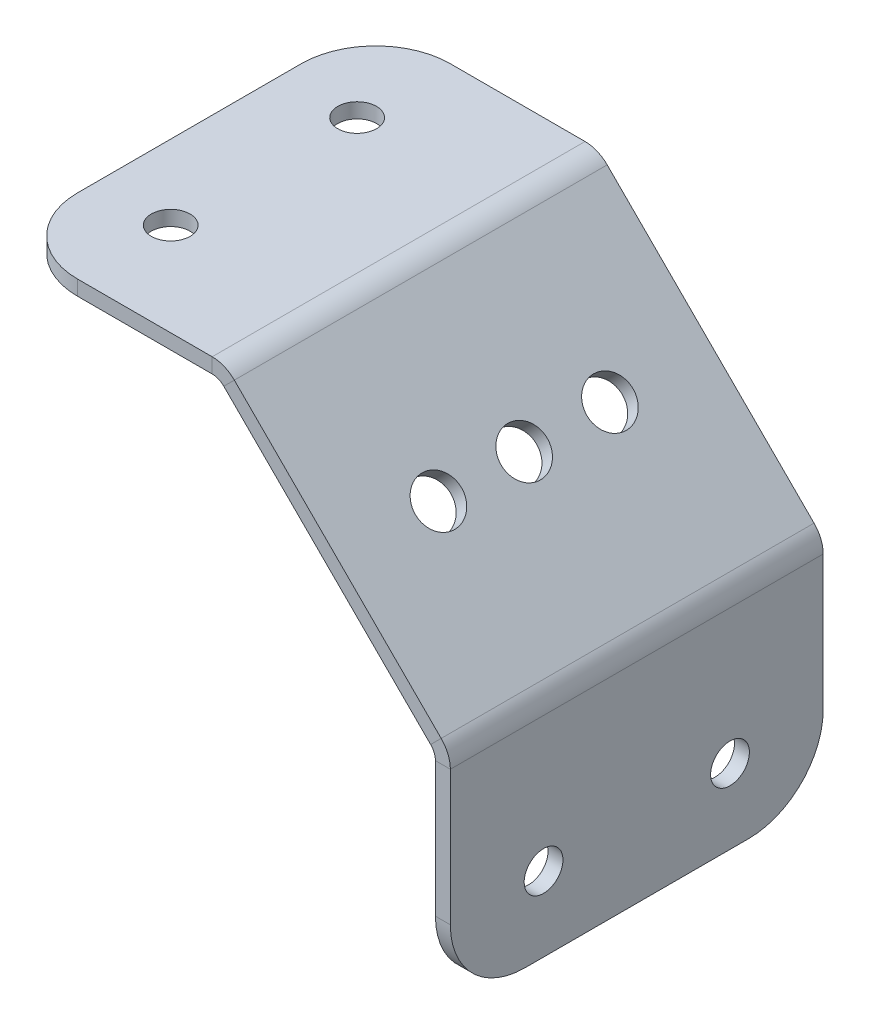
ISO-10303-21;
HEADER;
FILE_DESCRIPTION(('STEP AP214'),'2;1');
FILE_NAME('part.step','',(''),(''),'','','');
FILE_SCHEMA(('AUTOMOTIVE_DESIGN { 1 0 10303 214 1 1 1 1 }'));
ENDSEC;
DATA;
#1=APPLICATION_CONTEXT('core data for automotive mechanical design processes');
#2=APPLICATION_PROTOCOL_DEFINITION('international standard','automotive_design',2000,#1);
#3=PRODUCT_CONTEXT('',#1,'mechanical');
#4=PRODUCT('Part','Part','',(#3));
#5=PRODUCT_RELATED_PRODUCT_CATEGORY('part','',(#4));
#6=PRODUCT_DEFINITION_FORMATION('','',#4);
#7=PRODUCT_DEFINITION_CONTEXT('part definition',#1,'design');
#8=PRODUCT_DEFINITION('design','',#6,#7);
#9=PRODUCT_DEFINITION_SHAPE('','',#8);
#10=(LENGTH_UNIT() NAMED_UNIT(*) SI_UNIT(.MILLI.,.METRE.));
#11=(NAMED_UNIT(*) PLANE_ANGLE_UNIT() SI_UNIT($,.RADIAN.));
#12=(NAMED_UNIT(*) SI_UNIT($,.STERADIAN.) SOLID_ANGLE_UNIT());
#13=UNCERTAINTY_MEASURE_WITH_UNIT(LENGTH_MEASURE(1.E-05),#10,'distance_accuracy_value','');
#14=(GEOMETRIC_REPRESENTATION_CONTEXT(3) GLOBAL_UNCERTAINTY_ASSIGNED_CONTEXT((#13)) GLOBAL_UNIT_ASSIGNED_CONTEXT((#10,
#11,#12)) REPRESENTATION_CONTEXT('',''));
#15=CARTESIAN_POINT('',(0.,0.,0.));
#16=DIRECTION('',(0.,0.,1.));
#17=DIRECTION('',(1.,0.,0.));
#18=AXIS2_PLACEMENT_3D('',#15,#16,#17);
#19=CARTESIAN_POINT('',(2.25354831445098,34.1905209076565,-25.));
#20=DIRECTION('',(0.,0.,-1.));
#21=DIRECTION('',(-1.,0.,0.));
#22=AXIS2_PLACEMENT_3D('',#19,#20,#21);
#23=PLANE('',#22);
#24=DIRECTION('',(0.707106781186538,-0.707106781186557,0.));
#25=VECTOR('',#24,1.);
#26=CARTESIAN_POINT('',(3.16481815167181,32.1905209076565,-25.));
#27=LINE('',#26,#25);
#28=CARTESIAN_POINT('',(3.80918323306141,31.5461558262669,-25.));
#29=VERTEX_POINT('',#28);
#30=CARTESIAN_POINT('',(31.5461558262669,3.80918323306073,-25.));
#31=VERTEX_POINT('',#30);
#32=EDGE_CURVE('E59',#29,#31,#27,.T.);
#33=ORIENTED_EDGE('',*,*,#32,.F.);
#34=DIRECTION('',(0.707106781186557,0.707106781186538,0.));
#35=VECTOR('',#34,1.);
#36=CARTESIAN_POINT('',(3.80918323306142,31.5461558262669,-25.));
#37=LINE('',#36,#35);
#38=CARTESIAN_POINT('',(5.22339679543453,32.96036938864,-25.));
#39=VERTEX_POINT('',#38);
#40=EDGE_CURVE('E346',#29,#39,#37,.T.);
#41=ORIENTED_EDGE('',*,*,#40,.T.);
#42=DIRECTION('',(0.707106781186538,-0.707106781186557,0.));
#43=VECTOR('',#42,1.);
#44=CARTESIAN_POINT('',(4.57903171404493,33.6047344700296,-25.));
#45=LINE('',#44,#43);
#46=CARTESIAN_POINT('',(32.96036938864,5.2233967954338,-25.));
#47=VERTEX_POINT('',#46);
#48=EDGE_CURVE('E325',#39,#47,#45,.T.);
#49=ORIENTED_EDGE('',*,*,#48,.T.);
#50=DIRECTION('',(-0.707106781186557,-0.707106781186537,0.));
#51=VECTOR('',#50,1.);
#52=CARTESIAN_POINT('',(32.96036938864,5.2233967954338,-25.));
#53=LINE('',#52,#51);
#54=EDGE_CURVE('E342',#47,#31,#53,.T.);
#55=ORIENTED_EDGE('',*,*,#54,.T.);
#56=EDGE_LOOP('',(#33,#41,#49,#55));
#57=FACE_BOUND('',#56,.T.);
#58=ADVANCED_FACE('F38',(#57),#23,.T.);
#59=CARTESIAN_POINT('',(34.1905209076564,2.25354831445035,25.));
#60=DIRECTION('',(0.,0.,1.));
#61=DIRECTION('',(1.,0.,0.));
#62=AXIS2_PLACEMENT_3D('',#59,#60,#61);
#63=PLANE('',#62);
#64=DIRECTION('',(0.707106781186538,-0.707106781186557,0.));
#65=VECTOR('',#64,1.);
#66=CARTESIAN_POINT('',(3.16481815167181,32.1905209076565,25.));
#67=LINE('',#66,#65);
#68=CARTESIAN_POINT('',(3.80918323306142,31.5461558262669,25.));
#69=VERTEX_POINT('',#68);
#70=CARTESIAN_POINT('',(31.5461558262669,3.80918323306072,25.));
#71=VERTEX_POINT('',#70);
#72=EDGE_CURVE('E52',#69,#71,#67,.T.);
#73=ORIENTED_EDGE('',*,*,#72,.T.);
#74=DIRECTION('',(0.707106781186557,0.707106781186537,0.));
#75=VECTOR('',#74,1.);
#76=CARTESIAN_POINT('',(31.5461558262669,3.80918323306073,25.));
#77=LINE('',#76,#75);
#78=CARTESIAN_POINT('',(32.96036938864,5.2233967954338,25.));
#79=VERTEX_POINT('',#78);
#80=EDGE_CURVE('E337',#71,#79,#77,.T.);
#81=ORIENTED_EDGE('',*,*,#80,.T.);
#82=DIRECTION('',(0.707106781186538,-0.707106781186557,0.));
#83=VECTOR('',#82,1.);
#84=CARTESIAN_POINT('',(4.57903171404493,33.6047344700296,25.));
#85=LINE('',#84,#83);
#86=CARTESIAN_POINT('',(5.22339679543453,32.96036938864,25.));
#87=VERTEX_POINT('',#86);
#88=EDGE_CURVE('E320',#87,#79,#85,.T.);
#89=ORIENTED_EDGE('',*,*,#88,.F.);
#90=DIRECTION('',(-0.707106781186557,-0.707106781186538,0.));
#91=VECTOR('',#90,1.);
#92=CARTESIAN_POINT('',(5.22339679543453,32.96036938864,25.));
#93=LINE('',#92,#91);
#94=EDGE_CURVE('E11',#87,#69,#93,.T.);
#95=ORIENTED_EDGE('',*,*,#94,.T.);
#96=EDGE_LOOP('',(#73,#81,#89,#95));
#97=FACE_BOUND('',#96,.T.);
#98=ADVANCED_FACE('F386',(#97),#63,.T.);
#99=CARTESIAN_POINT('',(4.57903171404493,33.6047344700296,25.));
#100=DIRECTION('',(0.707106781186557,0.707106781186538,0.));
#101=DIRECTION('',(-0.707106781186538,0.707106781186557,0.));
#102=AXIS2_PLACEMENT_3D('',#99,#100,#101);
#103=PLANE('',#102);
#104=CARTESIAN_POINT('',(19.0918830920373,19.0918830920368,-11.5));
#105=DIRECTION('',(0.707106781186547,0.707106781186548,0.));
#106=DIRECTION('',(-0.707106781186548,0.707106781186547,0.));
#107=AXIS2_PLACEMENT_3D('',#104,#105,#106);
#108=CIRCLE('',#107,3.1);
#109=CARTESIAN_POINT('',(16.899852070359,21.2839141137151,-11.5));
#110=VERTEX_POINT('',#109);
#111=EDGE_CURVE('E304',#110,#110,#108,.T.);
#112=ORIENTED_EDGE('',*,*,#111,.F.);
#113=EDGE_LOOP('',(#112));
#114=FACE_BOUND('',#113,.T.);
#115=CARTESIAN_POINT('',(19.0918830920371,19.0918830920371,0.));
#116=DIRECTION('',(0.707106781186547,0.707106781186548,0.));
#117=DIRECTION('',(-0.707106781186548,0.707106781186547,0.));
#118=AXIS2_PLACEMENT_3D('',#115,#116,#117);
#119=CIRCLE('',#118,3.09999999999989);
#120=CARTESIAN_POINT('',(16.8998520703589,21.2839141137153,0.));
#121=VERTEX_POINT('',#120);
#122=EDGE_CURVE('E312',#121,#121,#119,.T.);
#123=ORIENTED_EDGE('',*,*,#122,.F.);
#124=EDGE_LOOP('',(#123));
#125=FACE_BOUND('',#124,.T.);
#126=CARTESIAN_POINT('',(19.0918830920373,19.0918830920368,11.5));
#127=DIRECTION('',(0.707106781186547,0.707106781186548,0.));
#128=DIRECTION('',(-0.707106781186548,0.707106781186547,0.));
#129=AXIS2_PLACEMENT_3D('',#126,#127,#128);
#130=CIRCLE('',#129,3.1);
#131=CARTESIAN_POINT('',(16.899852070359,21.2839141137151,11.5));
#132=VERTEX_POINT('',#131);
#133=EDGE_CURVE('E316',#132,#132,#130,.T.);
#134=ORIENTED_EDGE('',*,*,#133,.F.);
#135=EDGE_LOOP('',(#134));
#136=FACE_BOUND('',#135,.T.);
#137=ORIENTED_EDGE('',*,*,#48,.F.);
#138=DIRECTION('',(0.,0.,-1.));
#139=VECTOR('',#138,1.);
#140=CARTESIAN_POINT('',(5.22339679543453,32.96036938864,25.));
#141=LINE('',#140,#139);
#142=EDGE_CURVE('E344',#87,#39,#141,.T.);
#143=ORIENTED_EDGE('',*,*,#142,.F.);
#144=ORIENTED_EDGE('',*,*,#88,.T.);
#145=DIRECTION('',(0.,0.,-1.));
#146=VECTOR('',#145,1.);
#147=CARTESIAN_POINT('',(32.96036938864,5.2233967954338,25.));
#148=LINE('',#147,#146);
#149=EDGE_CURVE('E324',#79,#47,#148,.T.);
#150=ORIENTED_EDGE('',*,*,#149,.T.);
#151=EDGE_LOOP('',(#137,#143,#144,#150));
#152=FACE_BOUND('',#151,.T.);
#153=ADVANCED_FACE('F390',(#114,#125,#136,#152),#103,.T.);
#154=CARTESIAN_POINT('',(3.16481815167181,32.1905209076565,25.));
#155=DIRECTION('',(0.707106781186557,0.707106781186538,0.));
#156=DIRECTION('',(-0.707106781186538,0.707106781186557,0.));
#157=AXIS2_PLACEMENT_3D('',#154,#155,#156);
#158=PLANE('',#157);
#159=CARTESIAN_POINT('',(17.6776695296642,17.6776695296637,-11.5));
#160=DIRECTION('',(0.707106781186557,0.707106781186538,0.));
#161=DIRECTION('',(-0.707106781186538,0.707106781186557,0.));
#162=AXIS2_PLACEMENT_3D('',#159,#160,#161);
#163=CIRCLE('',#162,3.1);
#164=CARTESIAN_POINT('',(15.485638507986,19.8697005513421,-11.5));
#165=VERTEX_POINT('',#164);
#166=EDGE_CURVE('E311',#165,#165,#163,.T.);
#167=ORIENTED_EDGE('',*,*,#166,.T.);
#168=EDGE_LOOP('',(#167));
#169=FACE_BOUND('',#168,.T.);
#170=CARTESIAN_POINT('',(17.677669529664,17.677669529664,0.));
#171=DIRECTION('',(0.707106781186557,0.707106781186538,0.));
#172=DIRECTION('',(-0.707106781186538,0.707106781186557,0.));
#173=AXIS2_PLACEMENT_3D('',#170,#171,#172);
#174=CIRCLE('',#173,3.09999999999989);
#175=CARTESIAN_POINT('',(15.4856385079858,19.8697005513422,0.));
#176=VERTEX_POINT('',#175);
#177=EDGE_CURVE('E315',#176,#176,#174,.T.);
#178=ORIENTED_EDGE('',*,*,#177,.T.);
#179=EDGE_LOOP('',(#178));
#180=FACE_BOUND('',#179,.T.);
#181=CARTESIAN_POINT('',(17.6776695296642,17.6776695296637,11.5));
#182=DIRECTION('',(0.707106781186557,0.707106781186538,0.));
#183=DIRECTION('',(-0.707106781186538,0.707106781186557,0.));
#184=AXIS2_PLACEMENT_3D('',#181,#182,#183);
#185=CIRCLE('',#184,3.1);
#186=CARTESIAN_POINT('',(15.485638507986,19.8697005513421,11.5));
#187=VERTEX_POINT('',#186);
#188=EDGE_CURVE('E319',#187,#187,#185,.T.);
#189=ORIENTED_EDGE('',*,*,#188,.T.);
#190=EDGE_LOOP('',(#189));
#191=FACE_BOUND('',#190,.T.);
#192=ORIENTED_EDGE('',*,*,#32,.T.);
#193=DIRECTION('',(0.,0.,-1.));
#194=VECTOR('',#193,1.);
#195=CARTESIAN_POINT('',(31.5461558262669,3.80918323306073,25.));
#196=LINE('',#195,#194);
#197=EDGE_CURVE('E340',#71,#31,#196,.T.);
#198=ORIENTED_EDGE('',*,*,#197,.F.);
#199=ORIENTED_EDGE('',*,*,#72,.F.);
#200=DIRECTION('',(0.,0.,-1.));
#201=VECTOR('',#200,1.);
#202=CARTESIAN_POINT('',(3.80918323306142,31.5461558262669,25.));
#203=LINE('',#202,#201);
#204=EDGE_CURVE('E45',#69,#29,#203,.T.);
#205=ORIENTED_EDGE('',*,*,#204,.T.);
#206=EDGE_LOOP('',(#192,#198,#199,#205));
#207=FACE_BOUND('',#206,.T.);
#208=ADVANCED_FACE('F349',(#169,#180,#191,#207),#158,.F.);
#209=CARTESIAN_POINT('',(12.0208152801719,12.0208152801713,11.5));
#210=DIRECTION('',(0.707106781186547,0.707106781186548,0.));
#211=DIRECTION('',(-0.707106781186548,0.707106781186547,0.));
#212=AXIS2_PLACEMENT_3D('',#209,#210,#211);
#213=CYLINDRICAL_SURFACE('',#212,3.1);
#214=ORIENTED_EDGE('',*,*,#133,.T.);
#215=EDGE_LOOP('',(#214));
#216=FACE_BOUND('',#215,.T.);
#217=ORIENTED_EDGE('',*,*,#188,.F.);
#218=EDGE_LOOP('',(#217));
#219=FACE_BOUND('',#218,.T.);
#220=ADVANCED_FACE('F400',(#216,#219),#213,.F.);
#221=CARTESIAN_POINT('',(12.0208152801716,12.0208152801716,0.));
#222=DIRECTION('',(0.707106781186547,0.707106781186548,0.));
#223=DIRECTION('',(-0.707106781186548,0.707106781186547,0.));
#224=AXIS2_PLACEMENT_3D('',#221,#222,#223);
#225=CYLINDRICAL_SURFACE('',#224,3.09999999999989);
#226=ORIENTED_EDGE('',*,*,#122,.T.);
#227=EDGE_LOOP('',(#226));
#228=FACE_BOUND('',#227,.T.);
#229=ORIENTED_EDGE('',*,*,#177,.F.);
#230=EDGE_LOOP('',(#229));
#231=FACE_BOUND('',#230,.T.);
#232=ADVANCED_FACE('F404',(#228,#231),#225,.F.);
#233=CARTESIAN_POINT('',(12.0208152801719,12.0208152801713,-11.5));
#234=DIRECTION('',(0.707106781186547,0.707106781186548,0.));
#235=DIRECTION('',(-0.707106781186548,0.707106781186547,0.));
#236=AXIS2_PLACEMENT_3D('',#233,#234,#235);
#237=CYLINDRICAL_SURFACE('',#236,3.1);
#238=ORIENTED_EDGE('',*,*,#111,.T.);
#239=EDGE_LOOP('',(#238));
#240=FACE_BOUND('',#239,.T.);
#241=ORIENTED_EDGE('',*,*,#166,.F.);
#242=EDGE_LOOP('',(#241));
#243=FACE_BOUND('',#242,.T.);
#244=ADVANCED_FACE('F408',(#240,#243),#237,.F.);
#245=CARTESIAN_POINT('',(29.9905209076564,2.25354831445033,25.));
#246=DIRECTION('',(0.,0.,1.));
#247=DIRECTION('',(0.707106781186536,-0.707106781186559,0.));
#248=AXIS2_PLACEMENT_3D('',#245,#246,#247);
#249=PLANE('',#248);
#250=ORIENTED_EDGE('',*,*,#80,.F.);
#251=CARTESIAN_POINT('',(29.9905209076564,2.25354831445033,25.));
#252=DIRECTION('',(0.,0.,-1.));
#253=DIRECTION('',(-0.707106781186536,0.707106781186559,0.));
#254=AXIS2_PLACEMENT_3D('',#251,#252,#253);
#255=CIRCLE('',#254,2.2);
#256=CARTESIAN_POINT('',(32.1905209076564,2.25354831445035,25.));
#257=VERTEX_POINT('',#256);
#258=EDGE_CURVE('E243',#71,#257,#255,.T.);
#259=ORIENTED_EDGE('',*,*,#258,.T.);
#260=DIRECTION('',(-1.,0.,0.));
#261=VECTOR('',#260,1.);
#262=CARTESIAN_POINT('',(34.1905209076564,2.25354831445035,25.));
#263=LINE('',#262,#261);
#264=CARTESIAN_POINT('',(34.1905209076564,2.25354831445035,25.));
#265=VERTEX_POINT('',#264);
#266=EDGE_CURVE('E266',#265,#257,#263,.T.);
#267=ORIENTED_EDGE('',*,*,#266,.F.);
#268=CARTESIAN_POINT('',(29.9905209076564,2.25354831445033,25.));
#269=DIRECTION('',(0.,0.,-1.));
#270=DIRECTION('',(-0.707106781186536,0.707106781186559,0.));
#271=AXIS2_PLACEMENT_3D('',#268,#269,#270);
#272=CIRCLE('',#271,4.2);
#273=EDGE_CURVE('E297',#79,#265,#272,.T.);
#274=ORIENTED_EDGE('',*,*,#273,.F.);
#275=EDGE_LOOP('',(#250,#259,#267,#274));
#276=FACE_BOUND('',#275,.T.);
#277=ADVANCED_FACE('F412',(#276),#249,.T.);
#278=CARTESIAN_POINT('',(29.9905209076564,2.25354831445033,-25.));
#279=DIRECTION('',(0.,0.,-1.));
#280=DIRECTION('',(-0.707106781186536,0.707106781186559,0.));
#281=AXIS2_PLACEMENT_3D('',#278,#279,#280);
#282=PLANE('',#281);
#283=DIRECTION('',(1.,0.,0.));
#284=VECTOR('',#283,1.);
#285=CARTESIAN_POINT('',(32.1905209076564,2.25354831445035,-25.));
#286=LINE('',#285,#284);
#287=CARTESIAN_POINT('',(32.1905209076564,2.25354831445035,-25.));
#288=VERTEX_POINT('',#287);
#289=CARTESIAN_POINT('',(34.1905209076564,2.25354831445036,-25.));
#290=VERTEX_POINT('',#289);
#291=EDGE_CURVE('E241',#288,#290,#286,.T.);
#292=ORIENTED_EDGE('',*,*,#291,.F.);
#293=CARTESIAN_POINT('',(29.9905209076564,2.25354831445033,-25.));
#294=DIRECTION('',(0.,0.,-1.));
#295=DIRECTION('',(-0.707106781186536,0.707106781186559,0.));
#296=AXIS2_PLACEMENT_3D('',#293,#294,#295);
#297=CIRCLE('',#296,2.2);
#298=EDGE_CURVE('E301',#288,#31,#297,.F.);
#299=ORIENTED_EDGE('',*,*,#298,.T.);
#300=ORIENTED_EDGE('',*,*,#54,.F.);
#301=CARTESIAN_POINT('',(29.9905209076564,2.25354831445033,-25.));
#302=DIRECTION('',(0.,0.,1.));
#303=DIRECTION('',(0.707106781186536,-0.707106781186559,0.));
#304=AXIS2_PLACEMENT_3D('',#301,#302,#303);
#305=CIRCLE('',#304,4.2);
#306=EDGE_CURVE('E300',#290,#47,#305,.T.);
#307=ORIENTED_EDGE('',*,*,#306,.F.);
#308=EDGE_LOOP('',(#292,#299,#300,#307));
#309=FACE_BOUND('',#308,.T.);
#310=ADVANCED_FACE('F416',(#309),#282,.T.);
#311=CARTESIAN_POINT('',(29.9905209076564,2.25354831445033,50.0984200194917));
#312=DIRECTION('',(0.,0.,-1.));
#313=DIRECTION('',(-0.707106781186536,0.707106781186559,0.));
#314=AXIS2_PLACEMENT_3D('',#311,#312,#313);
#315=CYLINDRICAL_SURFACE('',#314,4.2);
#316=ORIENTED_EDGE('',*,*,#306,.T.);
#317=ORIENTED_EDGE('',*,*,#149,.F.);
#318=ORIENTED_EDGE('',*,*,#273,.T.);
#319=DIRECTION('',(0.,0.,-1.));
#320=VECTOR('',#319,1.);
#321=CARTESIAN_POINT('',(34.1905209076564,2.25354831445035,25.));
#322=LINE('',#321,#320);
#323=EDGE_CURVE('E187',#265,#290,#322,.T.);
#324=ORIENTED_EDGE('',*,*,#323,.T.);
#325=EDGE_LOOP('',(#316,#317,#318,#324));
#326=FACE_BOUND('',#325,.T.);
#327=ADVANCED_FACE('F420',(#326),#315,.T.);
#328=CARTESIAN_POINT('',(29.9905209076564,2.25354831445033,50.0984200194917));
#329=DIRECTION('',(0.,0.,-1.));
#330=DIRECTION('',(-0.707106781186536,0.707106781186559,0.));
#331=AXIS2_PLACEMENT_3D('',#328,#329,#330);
#332=CYLINDRICAL_SURFACE('',#331,2.2);
#333=ORIENTED_EDGE('',*,*,#298,.F.);
#334=DIRECTION('',(0.,0.,-1.));
#335=VECTOR('',#334,1.);
#336=CARTESIAN_POINT('',(32.1905209076564,2.25354831445035,25.));
#337=LINE('',#336,#335);
#338=EDGE_CURVE('E255',#257,#288,#337,.T.);
#339=ORIENTED_EDGE('',*,*,#338,.F.);
#340=ORIENTED_EDGE('',*,*,#258,.F.);
#341=ORIENTED_EDGE('',*,*,#197,.T.);
#342=EDGE_LOOP('',(#333,#339,#340,#341));
#343=FACE_BOUND('',#342,.T.);
#344=ADVANCED_FACE('F422',(#343),#332,.F.);
#345=CARTESIAN_POINT('',(32.9603693886401,-15.809479092344,-15.));
#346=DIRECTION('',(-1.,0.,0.));
#347=DIRECTION('',(0.,-1.,0.));
#348=AXIS2_PLACEMENT_3D('',#345,#346,#347);
#349=CYLINDRICAL_SURFACE('',#348,10.);
#350=CARTESIAN_POINT('',(34.1905209076565,-15.809479092344,-15.));
#351=DIRECTION('',(1.,0.,0.));
#352=DIRECTION('',(0.,1.,0.));
#353=AXIS2_PLACEMENT_3D('',#350,#351,#352);
#354=CIRCLE('',#353,10.);
#355=CARTESIAN_POINT('',(34.1905209076565,-25.809479092344,-15.));
#356=VERTEX_POINT('',#355);
#357=CARTESIAN_POINT('',(34.1905209076565,-15.809479092344,-25.));
#358=VERTEX_POINT('',#357);
#359=EDGE_CURVE('E274',#356,#358,#354,.T.);
#360=ORIENTED_EDGE('',*,*,#359,.F.);
#361=DIRECTION('',(-1.,0.,0.));
#362=VECTOR('',#361,1.);
#363=CARTESIAN_POINT('',(34.1905209076565,-25.809479092344,-15.));
#364=LINE('',#363,#362);
#365=CARTESIAN_POINT('',(32.1905209076565,-25.809479092344,-15.));
#366=VERTEX_POINT('',#365);
#367=EDGE_CURVE('E290',#366,#356,#364,.F.);
#368=ORIENTED_EDGE('',*,*,#367,.F.);
#369=CARTESIAN_POINT('',(32.1905209076565,-15.809479092344,-15.));
#370=DIRECTION('',(1.,0.,0.));
#371=DIRECTION('',(0.,1.,0.));
#372=AXIS2_PLACEMENT_3D('',#369,#370,#371);
#373=CIRCLE('',#372,10.);
#374=CARTESIAN_POINT('',(32.1905209076565,-15.809479092344,-25.));
#375=VERTEX_POINT('',#374);
#376=EDGE_CURVE('E250',#375,#366,#373,.F.);
#377=ORIENTED_EDGE('',*,*,#376,.F.);
#378=DIRECTION('',(-1.,0.,0.));
#379=VECTOR('',#378,1.);
#380=CARTESIAN_POINT('',(32.9603693886401,-15.809479092344,-25.));
#381=LINE('',#380,#379);
#382=EDGE_CURVE('E244',#358,#375,#381,.T.);
#383=ORIENTED_EDGE('',*,*,#382,.F.);
#384=EDGE_LOOP('',(#360,#368,#377,#383));
#385=FACE_BOUND('',#384,.T.);
#386=ADVANCED_FACE('F425',(#385),#349,.T.);
#387=CARTESIAN_POINT('',(34.1905209076565,-25.809479092344,25.));
#388=DIRECTION('',(0.,-1.,0.));
#389=DIRECTION('',(1.,0.,0.));
#390=AXIS2_PLACEMENT_3D('',#387,#388,#389);
#391=PLANE('',#390);
#392=DIRECTION('',(0.,0.,-1.));
#393=VECTOR('',#392,1.);
#394=CARTESIAN_POINT('',(34.1905209076565,-25.809479092344,25.));
#395=LINE('',#394,#393);
#396=CARTESIAN_POINT('',(34.1905209076565,-25.809479092344,15.));
#397=VERTEX_POINT('',#396);
#398=EDGE_CURVE('E276',#397,#356,#395,.T.);
#399=ORIENTED_EDGE('',*,*,#398,.F.);
#400=DIRECTION('',(-1.,0.,0.));
#401=VECTOR('',#400,1.);
#402=CARTESIAN_POINT('',(34.1905209076565,-25.809479092344,15.));
#403=LINE('',#402,#401);
#404=CARTESIAN_POINT('',(32.1905209076565,-25.809479092344,15.));
#405=VERTEX_POINT('',#404);
#406=EDGE_CURVE('E190',#397,#405,#403,.T.);
#407=ORIENTED_EDGE('',*,*,#406,.T.);
#408=DIRECTION('',(0.,0.,-1.));
#409=VECTOR('',#408,1.);
#410=CARTESIAN_POINT('',(32.1905209076565,-25.809479092344,25.));
#411=LINE('',#410,#409);
#412=EDGE_CURVE('E292',#405,#366,#411,.T.);
#413=ORIENTED_EDGE('',*,*,#412,.T.);
#414=ORIENTED_EDGE('',*,*,#367,.T.);
#415=EDGE_LOOP('',(#399,#407,#413,#414));
#416=FACE_BOUND('',#415,.T.);
#417=ADVANCED_FACE('F457',(#416),#391,.T.);
#418=CARTESIAN_POINT('',(34.1905209076565,-15.809479092344,15.));
#419=DIRECTION('',(-1.,0.,0.));
#420=DIRECTION('',(0.,-1.,0.));
#421=AXIS2_PLACEMENT_3D('',#418,#419,#420);
#422=CYLINDRICAL_SURFACE('',#421,10.);
#423=CARTESIAN_POINT('',(34.1905209076565,-15.809479092344,15.));
#424=DIRECTION('',(1.,0.,0.));
#425=DIRECTION('',(0.,1.,0.));
#426=AXIS2_PLACEMENT_3D('',#423,#424,#425);
#427=CIRCLE('',#426,10.);
#428=CARTESIAN_POINT('',(34.1905209076565,-15.809479092344,25.));
#429=VERTEX_POINT('',#428);
#430=EDGE_CURVE('E279',#429,#397,#427,.T.);
#431=ORIENTED_EDGE('',*,*,#430,.F.);
#432=DIRECTION('',(-1.,0.,0.));
#433=VECTOR('',#432,1.);
#434=CARTESIAN_POINT('',(29.9905209076565,-15.809479092344,25.));
#435=LINE('',#434,#433);
#436=CARTESIAN_POINT('',(32.1905209076565,-15.809479092344,25.));
#437=VERTEX_POINT('',#436);
#438=EDGE_CURVE('E269',#437,#429,#435,.F.);
#439=ORIENTED_EDGE('',*,*,#438,.F.);
#440=CARTESIAN_POINT('',(32.1905209076565,-15.809479092344,15.));
#441=DIRECTION('',(1.,0.,0.));
#442=DIRECTION('',(0.,1.,0.));
#443=AXIS2_PLACEMENT_3D('',#440,#441,#442);
#444=CIRCLE('',#443,10.);
#445=EDGE_CURVE('E258',#405,#437,#444,.F.);
#446=ORIENTED_EDGE('',*,*,#445,.F.);
#447=ORIENTED_EDGE('',*,*,#406,.F.);
#448=EDGE_LOOP('',(#431,#439,#446,#447));
#449=FACE_BOUND('',#448,.T.);
#450=ADVANCED_FACE('F453',(#449),#422,.T.);
#451=CARTESIAN_POINT('',(24.1905209076563,-15.8094790923442,12.5));
#452=DIRECTION('',(1.,0.,0.));
#453=DIRECTION('',(0.,0.,1.));
#454=AXIS2_PLACEMENT_3D('',#451,#452,#453);
#455=CYLINDRICAL_SURFACE('',#454,2.59999999999999);
#456=CARTESIAN_POINT('',(34.1905209076563,-15.8094790923442,12.5));
#457=DIRECTION('',(1.,0.,0.));
#458=DIRECTION('',(0.,0.,-1.));
#459=AXIS2_PLACEMENT_3D('',#456,#457,#458);
#460=CIRCLE('',#459,2.59999999999999);
#461=CARTESIAN_POINT('',(34.1905209076563,-15.8094790923442,9.90000000000001));
#462=VERTEX_POINT('',#461);
#463=EDGE_CURVE('E287',#462,#462,#460,.T.);
#464=ORIENTED_EDGE('',*,*,#463,.T.);
#465=EDGE_LOOP('',(#464));
#466=FACE_BOUND('',#465,.T.);
#467=CARTESIAN_POINT('',(32.1905209076565,-15.8094790923442,12.5));
#468=DIRECTION('',(1.,0.,0.));
#469=DIRECTION('',(0.,1.,0.));
#470=AXIS2_PLACEMENT_3D('',#467,#468,#469);
#471=CIRCLE('',#470,2.59999999999999);
#472=CARTESIAN_POINT('',(32.1905209076565,-13.2094790923442,12.5));
#473=VERTEX_POINT('',#472);
#474=EDGE_CURVE('E260',#473,#473,#471,.T.);
#475=ORIENTED_EDGE('',*,*,#474,.F.);
#476=EDGE_LOOP('',(#475));
#477=FACE_BOUND('',#476,.T.);
#478=ADVANCED_FACE('F449',(#466,#477),#455,.F.);
#479=CARTESIAN_POINT('',(24.1905209076563,-15.8094790923442,-12.5));
#480=DIRECTION('',(1.,0.,0.));
#481=DIRECTION('',(0.,0.,1.));
#482=AXIS2_PLACEMENT_3D('',#479,#480,#481);
#483=CYLINDRICAL_SURFACE('',#482,2.59999999999999);
#484=CARTESIAN_POINT('',(34.1905209076563,-15.8094790923442,-12.5));
#485=DIRECTION('',(1.,0.,0.));
#486=DIRECTION('',(0.,0.,-1.));
#487=AXIS2_PLACEMENT_3D('',#484,#485,#486);
#488=CIRCLE('',#487,2.59999999999999);
#489=CARTESIAN_POINT('',(34.1905209076563,-15.8094790923442,-15.1));
#490=VERTEX_POINT('',#489);
#491=EDGE_CURVE('E284',#490,#490,#488,.T.);
#492=ORIENTED_EDGE('',*,*,#491,.T.);
#493=EDGE_LOOP('',(#492));
#494=FACE_BOUND('',#493,.T.);
#495=CARTESIAN_POINT('',(32.1905209076565,-15.8094790923442,-12.5));
#496=DIRECTION('',(1.,0.,0.));
#497=DIRECTION('',(0.,1.,0.));
#498=AXIS2_PLACEMENT_3D('',#495,#496,#497);
#499=CIRCLE('',#498,2.59999999999999);
#500=CARTESIAN_POINT('',(32.1905209076565,-13.2094790923442,-12.5));
#501=VERTEX_POINT('',#500);
#502=EDGE_CURVE('E263',#501,#501,#499,.T.);
#503=ORIENTED_EDGE('',*,*,#502,.F.);
#504=EDGE_LOOP('',(#503));
#505=FACE_BOUND('',#504,.T.);
#506=ADVANCED_FACE('F445',(#494,#505),#483,.F.);
#507=CARTESIAN_POINT('',(34.1905209076564,3.16481815167114,25.));
#508=DIRECTION('',(1.,0.,0.));
#509=DIRECTION('',(0.,1.,0.));
#510=AXIS2_PLACEMENT_3D('',#507,#508,#509);
#511=PLANE('',#510);
#512=ORIENTED_EDGE('',*,*,#491,.F.);
#513=EDGE_LOOP('',(#512));
#514=FACE_BOUND('',#513,.T.);
#515=ORIENTED_EDGE('',*,*,#463,.F.);
#516=EDGE_LOOP('',(#515));
#517=FACE_BOUND('',#516,.T.);
#518=DIRECTION('',(0.,-1.,0.));
#519=VECTOR('',#518,1.);
#520=CARTESIAN_POINT('',(34.1905209076564,3.16481815167114,25.));
#521=LINE('',#520,#519);
#522=EDGE_CURVE('E281',#265,#429,#521,.T.);
#523=ORIENTED_EDGE('',*,*,#522,.T.);
#524=ORIENTED_EDGE('',*,*,#430,.T.);
#525=ORIENTED_EDGE('',*,*,#398,.T.);
#526=ORIENTED_EDGE('',*,*,#359,.T.);
#527=DIRECTION('',(0.,-1.,0.));
#528=VECTOR('',#527,1.);
#529=CARTESIAN_POINT('',(34.1905209076564,3.16481815167114,-25.));
#530=LINE('',#529,#528);
#531=EDGE_CURVE('E247',#290,#358,#530,.T.);
#532=ORIENTED_EDGE('',*,*,#531,.F.);
#533=ORIENTED_EDGE('',*,*,#323,.F.);
#534=EDGE_LOOP('',(#523,#524,#525,#526,#532,#533));
#535=FACE_BOUND('',#534,.T.);
#536=ADVANCED_FACE('F441',(#514,#517,#535),#511,.T.);
#537=CARTESIAN_POINT('',(29.9905209076564,2.25354831445035,25.));
#538=DIRECTION('',(0.,0.,1.));
#539=DIRECTION('',(1.,0.,0.));
#540=AXIS2_PLACEMENT_3D('',#537,#538,#539);
#541=PLANE('',#540);
#542=DIRECTION('',(0.,-1.,0.));
#543=VECTOR('',#542,1.);
#544=CARTESIAN_POINT('',(32.1905209076564,3.16481815167114,25.));
#545=LINE('',#544,#543);
#546=EDGE_CURVE('E271',#257,#437,#545,.T.);
#547=ORIENTED_EDGE('',*,*,#546,.T.);
#548=ORIENTED_EDGE('',*,*,#438,.T.);
#549=ORIENTED_EDGE('',*,*,#522,.F.);
#550=ORIENTED_EDGE('',*,*,#266,.T.);
#551=EDGE_LOOP('',(#547,#548,#549,#550));
#552=FACE_BOUND('',#551,.T.);
#553=ADVANCED_FACE('F437',(#552),#541,.T.);
#554=CARTESIAN_POINT('',(32.1905209076564,3.16481815167114,25.));
#555=DIRECTION('',(1.,0.,0.));
#556=DIRECTION('',(0.,1.,0.));
#557=AXIS2_PLACEMENT_3D('',#554,#555,#556);
#558=PLANE('',#557);
#559=ORIENTED_EDGE('',*,*,#502,.T.);
#560=EDGE_LOOP('',(#559));
#561=FACE_BOUND('',#560,.T.);
#562=ORIENTED_EDGE('',*,*,#474,.T.);
#563=EDGE_LOOP('',(#562));
#564=FACE_BOUND('',#563,.T.);
#565=ORIENTED_EDGE('',*,*,#412,.F.);
#566=ORIENTED_EDGE('',*,*,#445,.T.);
#567=ORIENTED_EDGE('',*,*,#546,.F.);
#568=ORIENTED_EDGE('',*,*,#338,.T.);
#569=DIRECTION('',(0.,-1.,0.));
#570=VECTOR('',#569,1.);
#571=CARTESIAN_POINT('',(32.1905209076564,3.16481815167114,-25.));
#572=LINE('',#571,#570);
#573=EDGE_CURVE('E252',#288,#375,#572,.T.);
#574=ORIENTED_EDGE('',*,*,#573,.T.);
#575=ORIENTED_EDGE('',*,*,#376,.T.);
#576=EDGE_LOOP('',(#565,#566,#567,#568,#574,#575));
#577=FACE_BOUND('',#576,.T.);
#578=ADVANCED_FACE('F433',(#561,#564,#577),#558,.F.);
#579=CARTESIAN_POINT('',(32.96036938864,5.22339679543379,-25.));
#580=DIRECTION('',(0.,0.,-1.));
#581=DIRECTION('',(-1.,0.,0.));
#582=AXIS2_PLACEMENT_3D('',#579,#580,#581);
#583=PLANE('',#582);
#584=ORIENTED_EDGE('',*,*,#531,.T.);
#585=ORIENTED_EDGE('',*,*,#382,.T.);
#586=ORIENTED_EDGE('',*,*,#573,.F.);
#587=ORIENTED_EDGE('',*,*,#291,.T.);
#588=EDGE_LOOP('',(#584,#585,#586,#587));
#589=FACE_BOUND('',#588,.T.);
#590=ADVANCED_FACE('F430',(#589),#583,.T.);
#591=CARTESIAN_POINT('',(-15.8094790923435,32.1905209076565,15.));
#592=DIRECTION('',(0.,1.,0.));
#593=DIRECTION('',(-1.,0.,0.));
#594=AXIS2_PLACEMENT_3D('',#591,#592,#593);
#595=CYLINDRICAL_SURFACE('',#594,10.);
#596=CARTESIAN_POINT('',(-15.8094790923435,32.1905209076565,15.));
#597=DIRECTION('',(0.,1.,0.));
#598=DIRECTION('',(-1.,0.,0.));
#599=AXIS2_PLACEMENT_3D('',#596,#597,#598);
#600=CIRCLE('',#599,10.);
#601=CARTESIAN_POINT('',(-15.8094790923435,32.1905209076565,25.));
#602=VERTEX_POINT('',#601);
#603=CARTESIAN_POINT('',(-25.8094790923435,32.1905209076565,15.));
#604=VERTEX_POINT('',#603);
#605=EDGE_CURVE('E199',#602,#604,#600,.F.);
#606=ORIENTED_EDGE('',*,*,#605,.F.);
#607=DIRECTION('',(0.,1.,0.));
#608=VECTOR('',#607,1.);
#609=CARTESIAN_POINT('',(-15.8094790923435,32.96036938864,25.));
#610=LINE('',#609,#608);
#611=CARTESIAN_POINT('',(-15.8094790923435,34.1905209076565,25.));
#612=VERTEX_POINT('',#611);
#613=EDGE_CURVE('E192',#612,#602,#610,.F.);
#614=ORIENTED_EDGE('',*,*,#613,.F.);
#615=CARTESIAN_POINT('',(-15.8094790923435,34.1905209076565,15.));
#616=DIRECTION('',(0.,1.,0.));
#617=DIRECTION('',(-1.,0.,0.));
#618=AXIS2_PLACEMENT_3D('',#615,#616,#617);
#619=CIRCLE('',#618,10.);
#620=CARTESIAN_POINT('',(-25.8094790923435,34.1905209076565,15.));
#621=VERTEX_POINT('',#620);
#622=EDGE_CURVE('E178',#621,#612,#619,.T.);
#623=ORIENTED_EDGE('',*,*,#622,.F.);
#624=DIRECTION('',(0.,1.,0.));
#625=VECTOR('',#624,1.);
#626=CARTESIAN_POINT('',(-25.8094790923435,32.1905209076565,15.));
#627=LINE('',#626,#625);
#628=EDGE_CURVE('E231',#604,#621,#627,.T.);
#629=ORIENTED_EDGE('',*,*,#628,.F.);
#630=EDGE_LOOP('',(#606,#614,#623,#629));
#631=FACE_BOUND('',#630,.T.);
#632=ADVANCED_FACE('F383',(#631),#595,.T.);
#633=CARTESIAN_POINT('',(-25.8094790923435,32.1905209076565,25.));
#634=DIRECTION('',(-1.,0.,0.));
#635=DIRECTION('',(0.,-1.,0.));
#636=AXIS2_PLACEMENT_3D('',#633,#634,#635);
#637=PLANE('',#636);
#638=DIRECTION('',(0.,0.,-1.));
#639=VECTOR('',#638,1.);
#640=CARTESIAN_POINT('',(-25.8094790923435,34.1905209076565,25.));
#641=LINE('',#640,#639);
#642=CARTESIAN_POINT('',(-25.8094790923435,34.1905209076565,-15.));
#643=VERTEX_POINT('',#642);
#644=EDGE_CURVE('E236',#621,#643,#641,.T.);
#645=ORIENTED_EDGE('',*,*,#644,.T.);
#646=DIRECTION('',(0.,1.,0.));
#647=VECTOR('',#646,1.);
#648=CARTESIAN_POINT('',(-25.8094790923435,32.1905209076565,-15.));
#649=LINE('',#648,#647);
#650=CARTESIAN_POINT('',(-25.8094790923435,32.1905209076565,-15.));
#651=VERTEX_POINT('',#650);
#652=EDGE_CURVE('E234',#643,#651,#649,.F.);
#653=ORIENTED_EDGE('',*,*,#652,.T.);
#654=DIRECTION('',(0.,0.,-1.));
#655=VECTOR('',#654,1.);
#656=CARTESIAN_POINT('',(-25.8094790923435,32.1905209076565,25.));
#657=LINE('',#656,#655);
#658=EDGE_CURVE('E206',#604,#651,#657,.T.);
#659=ORIENTED_EDGE('',*,*,#658,.F.);
#660=ORIENTED_EDGE('',*,*,#628,.T.);
#661=EDGE_LOOP('',(#645,#653,#659,#660));
#662=FACE_BOUND('',#661,.T.);
#663=ADVANCED_FACE('F369',(#662),#637,.T.);
#664=CARTESIAN_POINT('',(-15.8094790923434,2.25354831445026,-15.));
#665=DIRECTION('',(0.,-1.,0.));
#666=DIRECTION('',(1.,0.,0.));
#667=AXIS2_PLACEMENT_3D('',#664,#665,#666);
#668=CYLINDRICAL_SURFACE('',#667,10.);
#669=CARTESIAN_POINT('',(-15.8094790923435,32.1905209076565,-15.));
#670=DIRECTION('',(0.,1.,0.));
#671=DIRECTION('',(-1.,0.,0.));
#672=AXIS2_PLACEMENT_3D('',#669,#670,#671);
#673=CIRCLE('',#672,10.);
#674=CARTESIAN_POINT('',(-15.8094790923435,32.1905209076565,-25.));
#675=VERTEX_POINT('',#674);
#676=EDGE_CURVE('E204',#651,#675,#673,.F.);
#677=ORIENTED_EDGE('',*,*,#676,.F.);
#678=ORIENTED_EDGE('',*,*,#652,.F.);
#679=CARTESIAN_POINT('',(-15.8094790923435,34.1905209076565,-15.));
#680=DIRECTION('',(0.,1.,0.));
#681=DIRECTION('',(-1.,0.,0.));
#682=AXIS2_PLACEMENT_3D('',#679,#680,#681);
#683=CIRCLE('',#682,10.);
#684=CARTESIAN_POINT('',(-15.8094790923435,34.1905209076565,-25.));
#685=VERTEX_POINT('',#684);
#686=EDGE_CURVE('E223',#685,#643,#683,.T.);
#687=ORIENTED_EDGE('',*,*,#686,.F.);
#688=DIRECTION('',(0.,1.,0.));
#689=VECTOR('',#688,1.);
#690=CARTESIAN_POINT('',(-15.8094790923435,34.1905209076565,-25.));
#691=LINE('',#690,#689);
#692=EDGE_CURVE('E172',#675,#685,#691,.T.);
#693=ORIENTED_EDGE('',*,*,#692,.F.);
#694=EDGE_LOOP('',(#677,#678,#687,#693));
#695=FACE_BOUND('',#694,.T.);
#696=ADVANCED_FACE('F372',(#695),#668,.T.);
#697=CARTESIAN_POINT('',(-15.8094790923435,24.1905209076565,12.5));
#698=DIRECTION('',(0.,1.,0.));
#699=DIRECTION('',(0.,0.,1.));
#700=AXIS2_PLACEMENT_3D('',#697,#698,#699);
#701=CYLINDRICAL_SURFACE('',#700,2.6);
#702=CARTESIAN_POINT('',(-15.8094790923435,34.1905209076565,12.5));
#703=DIRECTION('',(0.,1.,0.));
#704=DIRECTION('',(0.,0.,1.));
#705=AXIS2_PLACEMENT_3D('',#702,#703,#704);
#706=CIRCLE('',#705,2.6);
#707=CARTESIAN_POINT('',(-15.8094790923435,34.1905209076565,15.1));
#708=VERTEX_POINT('',#707);
#709=EDGE_CURVE('E228',#708,#708,#706,.T.);
#710=ORIENTED_EDGE('',*,*,#709,.T.);
#711=EDGE_LOOP('',(#710));
#712=FACE_BOUND('',#711,.T.);
#713=CARTESIAN_POINT('',(-15.8094790923435,32.1905209076565,12.5));
#714=DIRECTION('',(0.,1.,0.));
#715=DIRECTION('',(-1.,0.,0.));
#716=AXIS2_PLACEMENT_3D('',#713,#714,#715);
#717=CIRCLE('',#716,2.6);
#718=CARTESIAN_POINT('',(-18.4094790923435,32.1905209076565,12.5));
#719=VERTEX_POINT('',#718);
#720=EDGE_CURVE('E209',#719,#719,#717,.T.);
#721=ORIENTED_EDGE('',*,*,#720,.F.);
#722=EDGE_LOOP('',(#721));
#723=FACE_BOUND('',#722,.T.);
#724=ADVANCED_FACE('F374',(#712,#723),#701,.F.);
#725=CARTESIAN_POINT('',(-15.8094790923435,24.1905209076565,-12.5));
#726=DIRECTION('',(0.,1.,0.));
#727=DIRECTION('',(0.,0.,1.));
#728=AXIS2_PLACEMENT_3D('',#725,#726,#727);
#729=CYLINDRICAL_SURFACE('',#728,2.6);
#730=CARTESIAN_POINT('',(-15.8094790923435,34.1905209076565,-12.5));
#731=DIRECTION('',(0.,1.,0.));
#732=DIRECTION('',(0.,0.,1.));
#733=AXIS2_PLACEMENT_3D('',#730,#731,#732);
#734=CIRCLE('',#733,2.6);
#735=CARTESIAN_POINT('',(-15.8094790923435,34.1905209076565,-9.9));
#736=VERTEX_POINT('',#735);
#737=EDGE_CURVE('E225',#736,#736,#734,.T.);
#738=ORIENTED_EDGE('',*,*,#737,.T.);
#739=EDGE_LOOP('',(#738));
#740=FACE_BOUND('',#739,.T.);
#741=CARTESIAN_POINT('',(-15.8094790923435,32.1905209076565,-12.5));
#742=DIRECTION('',(0.,1.,0.));
#743=DIRECTION('',(-1.,0.,0.));
#744=AXIS2_PLACEMENT_3D('',#741,#742,#743);
#745=CIRCLE('',#744,2.6);
#746=CARTESIAN_POINT('',(-18.4094790923435,32.1905209076565,-12.5));
#747=VERTEX_POINT('',#746);
#748=EDGE_CURVE('E212',#747,#747,#745,.T.);
#749=ORIENTED_EDGE('',*,*,#748,.F.);
#750=EDGE_LOOP('',(#749));
#751=FACE_BOUND('',#750,.T.);
#752=ADVANCED_FACE('F380',(#740,#751),#729,.F.);
#753=CARTESIAN_POINT('',(-25.8094790923435,34.1905209076565,25.));
#754=DIRECTION('',(0.,1.,0.));
#755=DIRECTION('',(-1.,0.,0.));
#756=AXIS2_PLACEMENT_3D('',#753,#754,#755);
#757=PLANE('',#756);
#758=ORIENTED_EDGE('',*,*,#737,.F.);
#759=EDGE_LOOP('',(#758));
#760=FACE_BOUND('',#759,.T.);
#761=ORIENTED_EDGE('',*,*,#709,.F.);
#762=EDGE_LOOP('',(#761));
#763=FACE_BOUND('',#762,.T.);
#764=DIRECTION('',(1.,0.,0.));
#765=VECTOR('',#764,1.);
#766=CARTESIAN_POINT('',(-25.8094790923435,34.1905209076565,-25.));
#767=LINE('',#766,#765);
#768=CARTESIAN_POINT('',(2.25354831445098,34.1905209076565,-25.));
#769=VERTEX_POINT('',#768);
#770=EDGE_CURVE('E218',#685,#769,#767,.T.);
#771=ORIENTED_EDGE('',*,*,#770,.F.);
#772=ORIENTED_EDGE('',*,*,#686,.T.);
#773=ORIENTED_EDGE('',*,*,#644,.F.);
#774=ORIENTED_EDGE('',*,*,#622,.T.);
#775=DIRECTION('',(1.,0.,0.));
#776=VECTOR('',#775,1.);
#777=CARTESIAN_POINT('',(-25.8094790923435,34.1905209076565,25.));
#778=LINE('',#777,#776);
#779=CARTESIAN_POINT('',(2.25354831445098,34.1905209076565,25.));
#780=VERTEX_POINT('',#779);
#781=EDGE_CURVE('E173',#612,#780,#778,.T.);
#782=ORIENTED_EDGE('',*,*,#781,.T.);
#783=DIRECTION('',(0.,0.,-1.));
#784=VECTOR('',#783,1.);
#785=CARTESIAN_POINT('',(2.25354831445098,34.1905209076565,25.));
#786=LINE('',#785,#784);
#787=EDGE_CURVE('E165',#780,#769,#786,.T.);
#788=ORIENTED_EDGE('',*,*,#787,.T.);
#789=EDGE_LOOP('',(#771,#772,#773,#774,#782,#788));
#790=FACE_BOUND('',#789,.T.);
#791=ADVANCED_FACE('F176',(#760,#763,#790),#757,.T.);
#792=CARTESIAN_POINT('',(29.9905209076564,2.25354831445034,-25.));
#793=DIRECTION('',(0.,0.,1.));
#794=DIRECTION('',(1.,0.,0.));
#795=AXIS2_PLACEMENT_3D('',#792,#793,#794);
#796=PLANE('',#795);
#797=DIRECTION('',(1.,0.,0.));
#798=VECTOR('',#797,1.);
#799=CARTESIAN_POINT('',(-25.8094790923435,32.1905209076565,-25.));
#800=LINE('',#799,#798);
#801=CARTESIAN_POINT('',(2.25354831445098,32.1905209076565,-25.));
#802=VERTEX_POINT('',#801);
#803=EDGE_CURVE('E201',#675,#802,#800,.T.);
#804=ORIENTED_EDGE('',*,*,#803,.F.);
#805=ORIENTED_EDGE('',*,*,#692,.T.);
#806=ORIENTED_EDGE('',*,*,#770,.T.);
#807=DIRECTION('',(0.,-1.,0.));
#808=VECTOR('',#807,1.);
#809=CARTESIAN_POINT('',(2.25354831445098,34.1905209076565,-25.));
#810=LINE('',#809,#808);
#811=EDGE_CURVE('E215',#769,#802,#810,.T.);
#812=ORIENTED_EDGE('',*,*,#811,.T.);
#813=EDGE_LOOP('',(#804,#805,#806,#812));
#814=FACE_BOUND('',#813,.T.);
#815=ADVANCED_FACE('F365',(#814),#796,.F.);
#816=CARTESIAN_POINT('',(-25.8094790923435,32.1905209076565,25.));
#817=DIRECTION('',(0.,1.,0.));
#818=DIRECTION('',(-1.,0.,0.));
#819=AXIS2_PLACEMENT_3D('',#816,#817,#818);
#820=PLANE('',#819);
#821=ORIENTED_EDGE('',*,*,#748,.T.);
#822=EDGE_LOOP('',(#821));
#823=FACE_BOUND('',#822,.T.);
#824=ORIENTED_EDGE('',*,*,#720,.T.);
#825=EDGE_LOOP('',(#824));
#826=FACE_BOUND('',#825,.T.);
#827=ORIENTED_EDGE('',*,*,#658,.T.);
#828=ORIENTED_EDGE('',*,*,#676,.T.);
#829=ORIENTED_EDGE('',*,*,#803,.T.);
#830=DIRECTION('',(0.,0.,-1.));
#831=VECTOR('',#830,1.);
#832=CARTESIAN_POINT('',(2.25354831445098,32.1905209076565,25.));
#833=LINE('',#832,#831);
#834=CARTESIAN_POINT('',(2.25354831445098,32.1905209076565,25.));
#835=VERTEX_POINT('',#834);
#836=EDGE_CURVE('E239',#835,#802,#833,.T.);
#837=ORIENTED_EDGE('',*,*,#836,.F.);
#838=DIRECTION('',(1.,0.,0.));
#839=VECTOR('',#838,1.);
#840=CARTESIAN_POINT('',(-25.8094790923435,32.1905209076565,25.));
#841=LINE('',#840,#839);
#842=EDGE_CURVE('E185',#602,#835,#841,.T.);
#843=ORIENTED_EDGE('',*,*,#842,.F.);
#844=ORIENTED_EDGE('',*,*,#605,.T.);
#845=EDGE_LOOP('',(#827,#828,#829,#837,#843,#844));
#846=FACE_BOUND('',#845,.T.);
#847=ADVANCED_FACE('F359',(#823,#826,#846),#820,.F.);
#848=CARTESIAN_POINT('',(5.22339679543453,32.96036938864,25.));
#849=DIRECTION('',(0.,0.,1.));
#850=DIRECTION('',(1.,0.,0.));
#851=AXIS2_PLACEMENT_3D('',#848,#849,#850);
#852=PLANE('',#851);
#853=ORIENTED_EDGE('',*,*,#781,.F.);
#854=ORIENTED_EDGE('',*,*,#613,.T.);
#855=ORIENTED_EDGE('',*,*,#842,.T.);
#856=DIRECTION('',(0.,1.,0.));
#857=VECTOR('',#856,1.);
#858=CARTESIAN_POINT('',(2.25354831445098,32.1905209076565,25.));
#859=LINE('',#858,#857);
#860=EDGE_CURVE('E156',#835,#780,#859,.T.);
#861=ORIENTED_EDGE('',*,*,#860,.T.);
#862=EDGE_LOOP('',(#853,#854,#855,#861));
#863=FACE_BOUND('',#862,.T.);
#864=ADVANCED_FACE('F183',(#863),#852,.T.);
#865=CARTESIAN_POINT('',(2.25354831445099,29.9905209076565,25.));
#866=DIRECTION('',(0.,0.,1.));
#867=DIRECTION('',(1.,0.,0.));
#868=AXIS2_PLACEMENT_3D('',#865,#866,#867);
#869=PLANE('',#868);
#870=ORIENTED_EDGE('',*,*,#860,.F.);
#871=CARTESIAN_POINT('',(2.25354831445099,29.9905209076565,25.));
#872=DIRECTION('',(0.,0.,-1.));
#873=DIRECTION('',(-1.,0.,0.));
#874=AXIS2_PLACEMENT_3D('',#871,#872,#873);
#875=CIRCLE('',#874,2.2);
#876=EDGE_CURVE('E195',#835,#69,#875,.T.);
#877=ORIENTED_EDGE('',*,*,#876,.T.);
#878=ORIENTED_EDGE('',*,*,#94,.F.);
#879=CARTESIAN_POINT('',(2.25354831445099,29.9905209076565,25.));
#880=DIRECTION('',(0.,0.,-1.));
#881=DIRECTION('',(-1.,0.,0.));
#882=AXIS2_PLACEMENT_3D('',#879,#880,#881);
#883=CIRCLE('',#882,4.2);
#884=EDGE_CURVE('E151',#780,#87,#883,.T.);
#885=ORIENTED_EDGE('',*,*,#884,.F.);
#886=EDGE_LOOP('',(#870,#877,#878,#885));
#887=FACE_BOUND('',#886,.T.);
#888=ADVANCED_FACE('F153',(#887),#869,.T.);
#889=CARTESIAN_POINT('',(2.25354831445099,29.9905209076565,-25.));
#890=DIRECTION('',(0.,0.,-1.));
#891=DIRECTION('',(-1.,0.,0.));
#892=AXIS2_PLACEMENT_3D('',#889,#890,#891);
#893=PLANE('',#892);
#894=ORIENTED_EDGE('',*,*,#40,.F.);
#895=CARTESIAN_POINT('',(2.25354831445099,29.9905209076565,-25.));
#896=DIRECTION('',(0.,0.,-1.));
#897=DIRECTION('',(-1.,0.,0.));
#898=AXIS2_PLACEMENT_3D('',#895,#896,#897);
#899=CIRCLE('',#898,2.2);
#900=EDGE_CURVE('E161',#29,#802,#899,.F.);
#901=ORIENTED_EDGE('',*,*,#900,.T.);
#902=ORIENTED_EDGE('',*,*,#811,.F.);
#903=CARTESIAN_POINT('',(2.25354831445099,29.9905209076565,-25.));
#904=DIRECTION('',(0.,0.,1.));
#905=DIRECTION('',(1.,0.,0.));
#906=AXIS2_PLACEMENT_3D('',#903,#904,#905);
#907=CIRCLE('',#906,4.2);
#908=EDGE_CURVE('E160',#39,#769,#907,.T.);
#909=ORIENTED_EDGE('',*,*,#908,.F.);
#910=EDGE_LOOP('',(#894,#901,#902,#909));
#911=FACE_BOUND('',#910,.T.);
#912=ADVANCED_FACE('F354',(#911),#893,.T.);
#913=CARTESIAN_POINT('',(2.25354831445099,29.9905209076565,50.0984200194917));
#914=DIRECTION('',(0.,0.,-1.));
#915=DIRECTION('',(-1.,0.,0.));
#916=AXIS2_PLACEMENT_3D('',#913,#914,#915);
#917=CYLINDRICAL_SURFACE('',#916,4.2);
#918=ORIENTED_EDGE('',*,*,#908,.T.);
#919=ORIENTED_EDGE('',*,*,#787,.F.);
#920=ORIENTED_EDGE('',*,*,#884,.T.);
#921=ORIENTED_EDGE('',*,*,#142,.T.);
#922=EDGE_LOOP('',(#918,#919,#920,#921));
#923=FACE_BOUND('',#922,.T.);
#924=ADVANCED_FACE('F167',(#923),#917,.T.);
#925=CARTESIAN_POINT('',(2.25354831445099,29.9905209076565,50.0984200194917));
#926=DIRECTION('',(0.,0.,-1.));
#927=DIRECTION('',(-1.,0.,0.));
#928=AXIS2_PLACEMENT_3D('',#925,#926,#927);
#929=CYLINDRICAL_SURFACE('',#928,2.2);
#930=ORIENTED_EDGE('',*,*,#900,.F.);
#931=ORIENTED_EDGE('',*,*,#204,.F.);
#932=ORIENTED_EDGE('',*,*,#876,.F.);
#933=ORIENTED_EDGE('',*,*,#836,.T.);
#934=EDGE_LOOP('',(#930,#931,#932,#933));
#935=FACE_BOUND('',#934,.T.);
#936=ADVANCED_FACE('F356',(#935),#929,.F.);
#937=CLOSED_SHELL('',(#58,#98,#153,#208,#220,#232,#244,#277,#310,#327,#344,#386,#417,#450,#478,
#506,#536,#553,#578,#590,#632,#663,#696,#724,#752,#791,#815,#847,#864,#888,#912,#924,#936));
#938=MANIFOLD_SOLID_BREP('B2',#937);
#939=ADVANCED_BREP_SHAPE_REPRESENTATION('',(#18,#938),#14);
#940=SHAPE_DEFINITION_REPRESENTATION(#9,#939);
ENDSEC;
END-ISO-10303-21;
